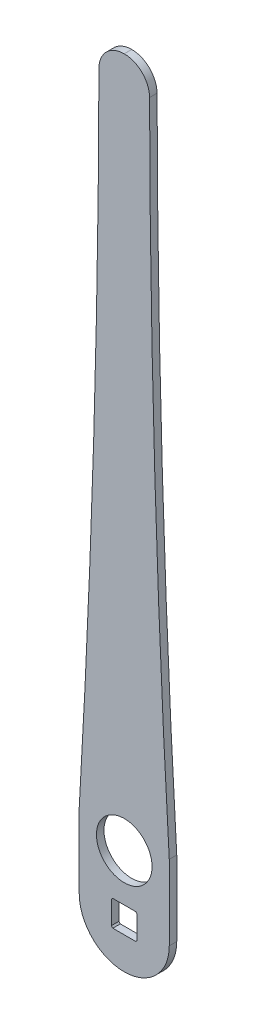
ISO-10303-21;
HEADER;
FILE_DESCRIPTION(('STEP AP214'),'2;1');
FILE_NAME('part.step','',(''),(''),'','','');
FILE_SCHEMA(('AUTOMOTIVE_DESIGN { 1 0 10303 214 1 1 1 1 }'));
ENDSEC;
DATA;
#1=APPLICATION_CONTEXT('core data for automotive mechanical design processes');
#2=APPLICATION_PROTOCOL_DEFINITION('international standard','automotive_design',2000,#1);
#3=PRODUCT_CONTEXT('',#1,'mechanical');
#4=PRODUCT('Part','Part','',(#3));
#5=PRODUCT_RELATED_PRODUCT_CATEGORY('part','',(#4));
#6=PRODUCT_DEFINITION_FORMATION('','',#4);
#7=PRODUCT_DEFINITION_CONTEXT('part definition',#1,'design');
#8=PRODUCT_DEFINITION('design','',#6,#7);
#9=PRODUCT_DEFINITION_SHAPE('','',#8);
#10=(LENGTH_UNIT() NAMED_UNIT(*) SI_UNIT(.MILLI.,.METRE.));
#11=(NAMED_UNIT(*) PLANE_ANGLE_UNIT() SI_UNIT($,.RADIAN.));
#12=(NAMED_UNIT(*) SI_UNIT($,.STERADIAN.) SOLID_ANGLE_UNIT());
#13=UNCERTAINTY_MEASURE_WITH_UNIT(LENGTH_MEASURE(1.E-05),#10,'distance_accuracy_value','');
#14=(GEOMETRIC_REPRESENTATION_CONTEXT(3) GLOBAL_UNCERTAINTY_ASSIGNED_CONTEXT((#13)) GLOBAL_UNIT_ASSIGNED_CONTEXT((#10,
#11,#12)) REPRESENTATION_CONTEXT('',''));
#15=CARTESIAN_POINT('',(0.,0.,0.));
#16=DIRECTION('',(0.,0.,1.));
#17=DIRECTION('',(1.,0.,0.));
#18=AXIS2_PLACEMENT_3D('',#15,#16,#17);
#19=CARTESIAN_POINT('',(-8.6,8.6,-5.));
#20=DIRECTION('',(-1.,0.,0.));
#21=DIRECTION('',(0.,-1.,0.));
#22=AXIS2_PLACEMENT_3D('',#19,#20,#21);
#23=PLANE('',#22);
#24=DIRECTION('',(0.,0.,1.));
#25=VECTOR('',#24,1.);
#26=CARTESIAN_POINT('',(-8.6,-7.63478879865055,-49.424357741048));
#27=LINE('',#26,#25);
#28=CARTESIAN_POINT('',(-8.6,-7.63478879865055,0.));
#29=VERTEX_POINT('',#28);
#30=CARTESIAN_POINT('',(-8.6,-7.63478879865055,5.));
#31=VERTEX_POINT('',#30);
#32=EDGE_CURVE('E281',#29,#31,#27,.T.);
#33=ORIENTED_EDGE('',*,*,#32,.F.);
#34=DIRECTION('',(0.,-1.,0.));
#35=VECTOR('',#34,1.);
#36=CARTESIAN_POINT('',(-8.6,0.,0.));
#37=LINE('',#36,#35);
#38=CARTESIAN_POINT('',(-8.6,7.63478879865055,0.));
#39=VERTEX_POINT('',#38);
#40=EDGE_CURVE('E184',#39,#29,#37,.T.);
#41=ORIENTED_EDGE('',*,*,#40,.F.);
#42=DIRECTION('',(0.,0.,1.));
#43=VECTOR('',#42,1.);
#44=CARTESIAN_POINT('',(-8.6,7.63478879865055,-49.424357741048));
#45=LINE('',#44,#43);
#46=CARTESIAN_POINT('',(-8.6,7.63478879865055,5.));
#47=VERTEX_POINT('',#46);
#48=EDGE_CURVE('E283',#47,#39,#45,.F.);
#49=ORIENTED_EDGE('',*,*,#48,.F.);
#50=DIRECTION('',(0.,-1.,0.));
#51=VECTOR('',#50,1.);
#52=CARTESIAN_POINT('',(-8.6,8.6,5.));
#53=LINE('',#52,#51);
#54=EDGE_CURVE('E278',#47,#31,#53,.T.);
#55=ORIENTED_EDGE('',*,*,#54,.T.);
#56=EDGE_LOOP('',(#33,#41,#49,#55));
#57=FACE_BOUND('',#56,.T.);
#58=ADVANCED_FACE('F39',(#57),#23,.F.);
#59=CARTESIAN_POINT('',(8.6,8.6,-5.));
#60=DIRECTION('',(0.,1.,0.));
#61=DIRECTION('',(-1.,0.,0.));
#62=AXIS2_PLACEMENT_3D('',#59,#60,#61);
#63=PLANE('',#62);
#64=DIRECTION('',(0.,0.,1.));
#65=VECTOR('',#64,1.);
#66=CARTESIAN_POINT('',(-7.63478879865056,8.6,-49.424357741048));
#67=LINE('',#66,#65);
#68=CARTESIAN_POINT('',(-7.63478879865056,8.6,0.));
#69=VERTEX_POINT('',#68);
#70=CARTESIAN_POINT('',(-7.63478879865056,8.6,5.));
#71=VERTEX_POINT('',#70);
#72=EDGE_CURVE('E285',#69,#71,#67,.T.);
#73=ORIENTED_EDGE('',*,*,#72,.F.);
#74=DIRECTION('',(-1.,0.,0.));
#75=VECTOR('',#74,1.);
#76=CARTESIAN_POINT('',(0.,8.6,0.));
#77=LINE('',#76,#75);
#78=CARTESIAN_POINT('',(7.63478879865055,8.6,0.));
#79=VERTEX_POINT('',#78);
#80=EDGE_CURVE('E181',#79,#69,#77,.T.);
#81=ORIENTED_EDGE('',*,*,#80,.F.);
#82=DIRECTION('',(0.,0.,1.));
#83=VECTOR('',#82,1.);
#84=CARTESIAN_POINT('',(7.63478879865055,8.6,-49.424357741048));
#85=LINE('',#84,#83);
#86=CARTESIAN_POINT('',(7.63478879865055,8.6,5.));
#87=VERTEX_POINT('',#86);
#88=EDGE_CURVE('E287',#87,#79,#85,.F.);
#89=ORIENTED_EDGE('',*,*,#88,.F.);
#90=DIRECTION('',(-1.,0.,0.));
#91=VECTOR('',#90,1.);
#92=CARTESIAN_POINT('',(8.6,8.6,5.));
#93=LINE('',#92,#91);
#94=EDGE_CURVE('E264',#87,#71,#93,.T.);
#95=ORIENTED_EDGE('',*,*,#94,.T.);
#96=EDGE_LOOP('',(#73,#81,#89,#95));
#97=FACE_BOUND('',#96,.T.);
#98=ADVANCED_FACE('F326',(#97),#63,.F.);
#99=CARTESIAN_POINT('',(8.6,8.6,-5.));
#100=DIRECTION('',(1.,0.,0.));
#101=DIRECTION('',(0.,1.,0.));
#102=AXIS2_PLACEMENT_3D('',#99,#100,#101);
#103=PLANE('',#102);
#104=DIRECTION('',(0.,0.,1.));
#105=VECTOR('',#104,1.);
#106=CARTESIAN_POINT('',(8.6,7.63478879865056,-49.424357741048));
#107=LINE('',#106,#105);
#108=CARTESIAN_POINT('',(8.6,7.63478879865056,0.));
#109=VERTEX_POINT('',#108);
#110=CARTESIAN_POINT('',(8.6,7.63478879865056,5.));
#111=VERTEX_POINT('',#110);
#112=EDGE_CURVE('E166',#109,#111,#107,.T.);
#113=ORIENTED_EDGE('',*,*,#112,.F.);
#114=DIRECTION('',(0.,1.,0.));
#115=VECTOR('',#114,1.);
#116=CARTESIAN_POINT('',(8.6,0.,0.));
#117=LINE('',#116,#115);
#118=CARTESIAN_POINT('',(8.6,-7.63478879865056,0.));
#119=VERTEX_POINT('',#118);
#120=EDGE_CURVE('E173',#119,#109,#117,.T.);
#121=ORIENTED_EDGE('',*,*,#120,.F.);
#122=DIRECTION('',(0.,0.,1.));
#123=VECTOR('',#122,1.);
#124=CARTESIAN_POINT('',(8.6,-7.63478879865056,-49.424357741048));
#125=LINE('',#124,#123);
#126=CARTESIAN_POINT('',(8.6,-7.63478879865056,5.));
#127=VERTEX_POINT('',#126);
#128=EDGE_CURVE('E155',#127,#119,#125,.F.);
#129=ORIENTED_EDGE('',*,*,#128,.F.);
#130=DIRECTION('',(0.,1.,0.));
#131=VECTOR('',#130,1.);
#132=CARTESIAN_POINT('',(8.6,8.6,5.));
#133=LINE('',#132,#131);
#134=EDGE_CURVE('E266',#127,#111,#133,.T.);
#135=ORIENTED_EDGE('',*,*,#134,.T.);
#136=EDGE_LOOP('',(#113,#121,#129,#135));
#137=FACE_BOUND('',#136,.T.);
#138=ADVANCED_FACE('F180',(#137),#103,.F.);
#139=CARTESIAN_POINT('',(8.6,-8.6,-5.));
#140=DIRECTION('',(0.,-1.,0.));
#141=DIRECTION('',(1.,0.,0.));
#142=AXIS2_PLACEMENT_3D('',#139,#140,#141);
#143=PLANE('',#142);
#144=DIRECTION('',(0.,0.,1.));
#145=VECTOR('',#144,1.);
#146=CARTESIAN_POINT('',(7.63478879865056,-8.6,-49.424357741048));
#147=LINE('',#146,#145);
#148=CARTESIAN_POINT('',(7.63478879865056,-8.6,0.));
#149=VERTEX_POINT('',#148);
#150=CARTESIAN_POINT('',(7.63478879865056,-8.6,5.));
#151=VERTEX_POINT('',#150);
#152=EDGE_CURVE('E195',#149,#151,#147,.T.);
#153=ORIENTED_EDGE('',*,*,#152,.F.);
#154=DIRECTION('',(1.,0.,0.));
#155=VECTOR('',#154,1.);
#156=CARTESIAN_POINT('',(0.,-8.6,0.));
#157=LINE('',#156,#155);
#158=CARTESIAN_POINT('',(-7.63478879865055,-8.6,0.));
#159=VERTEX_POINT('',#158);
#160=EDGE_CURVE('E175',#159,#149,#157,.T.);
#161=ORIENTED_EDGE('',*,*,#160,.F.);
#162=DIRECTION('',(0.,0.,1.));
#163=VECTOR('',#162,1.);
#164=CARTESIAN_POINT('',(-7.63478879865055,-8.6,-49.424357741048));
#165=LINE('',#164,#163);
#166=CARTESIAN_POINT('',(-7.63478879865055,-8.6,5.));
#167=VERTEX_POINT('',#166);
#168=EDGE_CURVE('E192',#167,#159,#165,.F.);
#169=ORIENTED_EDGE('',*,*,#168,.F.);
#170=DIRECTION('',(1.,0.,0.));
#171=VECTOR('',#170,1.);
#172=CARTESIAN_POINT('',(8.6,-8.6,5.));
#173=LINE('',#172,#171);
#174=EDGE_CURVE('E275',#167,#151,#173,.T.);
#175=ORIENTED_EDGE('',*,*,#174,.T.);
#176=EDGE_LOOP('',(#153,#161,#169,#175));
#177=FACE_BOUND('',#176,.T.);
#178=ADVANCED_FACE('F317',(#177),#143,.F.);
#179=CARTESIAN_POINT('',(0.,0.,5.));
#180=DIRECTION('',(0.,0.,-1.));
#181=DIRECTION('',(-1.,0.,0.));
#182=AXIS2_PLACEMENT_3D('',#179,#180,#181);
#183=CYLINDRICAL_SURFACE('',#182,30.);
#184=CARTESIAN_POINT('',(0.,0.,0.));
#185=DIRECTION('',(0.,0.,1.));
#186=DIRECTION('',(1.,0.,0.));
#187=AXIS2_PLACEMENT_3D('',#184,#185,#186);
#188=CIRCLE('',#187,30.);
#189=CARTESIAN_POINT('',(-30.,0.,0.));
#190=VERTEX_POINT('',#189);
#191=CARTESIAN_POINT('',(30.,0.,0.));
#192=VERTEX_POINT('',#191);
#193=EDGE_CURVE('E236',#190,#192,#188,.T.);
#194=ORIENTED_EDGE('',*,*,#193,.T.);
#195=DIRECTION('',(0.,0.,-1.));
#196=VECTOR('',#195,1.);
#197=CARTESIAN_POINT('',(30.,0.,5.));
#198=LINE('',#197,#196);
#199=CARTESIAN_POINT('',(30.,0.,5.));
#200=VERTEX_POINT('',#199);
#201=EDGE_CURVE('E186',#200,#192,#198,.T.);
#202=ORIENTED_EDGE('',*,*,#201,.F.);
#203=CARTESIAN_POINT('',(0.,0.,5.));
#204=DIRECTION('',(0.,0.,1.));
#205=DIRECTION('',(1.,0.,0.));
#206=AXIS2_PLACEMENT_3D('',#203,#204,#205);
#207=CIRCLE('',#206,30.);
#208=CARTESIAN_POINT('',(-30.,0.,5.));
#209=VERTEX_POINT('',#208);
#210=EDGE_CURVE('E243',#209,#200,#207,.T.);
#211=ORIENTED_EDGE('',*,*,#210,.F.);
#212=DIRECTION('',(0.,0.,-1.));
#213=VECTOR('',#212,1.);
#214=CARTESIAN_POINT('',(-30.,0.,5.));
#215=LINE('',#214,#213);
#216=EDGE_CURVE('E244',#209,#190,#215,.T.);
#217=ORIENTED_EDGE('',*,*,#216,.T.);
#218=EDGE_LOOP('',(#194,#202,#211,#217));
#219=FACE_BOUND('',#218,.T.);
#220=ADVANCED_FACE('F261',(#219),#183,.T.);
#221=CARTESIAN_POINT('',(30.,0.,5.));
#222=DIRECTION('',(-1.,0.,0.));
#223=DIRECTION('',(0.,0.,1.));
#224=AXIS2_PLACEMENT_3D('',#221,#222,#223);
#225=PLANE('',#224);
#226=DIRECTION('',(0.,1.,0.));
#227=VECTOR('',#226,1.);
#228=CARTESIAN_POINT('',(30.,0.,0.));
#229=LINE('',#228,#227);
#230=CARTESIAN_POINT('',(29.9999999999994,50.0000000000009,0.));
#231=VERTEX_POINT('',#230);
#232=EDGE_CURVE('E232',#192,#231,#229,.T.);
#233=ORIENTED_EDGE('',*,*,#232,.T.);
#234=DIRECTION('',(0.,0.,-1.));
#235=VECTOR('',#234,1.);
#236=CARTESIAN_POINT('',(29.9999999999994,50.0000000000009,5.));
#237=LINE('',#236,#235);
#238=CARTESIAN_POINT('',(29.9999999999994,50.0000000000009,5.));
#239=VERTEX_POINT('',#238);
#240=EDGE_CURVE('E231',#239,#231,#237,.T.);
#241=ORIENTED_EDGE('',*,*,#240,.F.);
#242=DIRECTION('',(0.,1.,0.));
#243=VECTOR('',#242,1.);
#244=CARTESIAN_POINT('',(30.,0.,5.));
#245=LINE('',#244,#243);
#246=EDGE_CURVE('E256',#200,#239,#245,.T.);
#247=ORIENTED_EDGE('',*,*,#246,.F.);
#248=ORIENTED_EDGE('',*,*,#201,.T.);
#249=EDGE_LOOP('',(#233,#241,#247,#248));
#250=FACE_BOUND('',#249,.T.);
#251=ADVANCED_FACE('F255',(#250),#225,.F.);
#252=CARTESIAN_POINT('',(7723.04477186312,500.,5.));
#253=DIRECTION('',(0.,0.,-1.));
#254=DIRECTION('',(-1.,0.,0.));
#255=AXIS2_PLACEMENT_3D('',#252,#253,#254);
#256=CYLINDRICAL_SURFACE('',#255,7706.19477186312);
#257=CARTESIAN_POINT('',(7723.04477186312,500.,0.));
#258=DIRECTION('',(0.,0.,-1.));
#259=DIRECTION('',(-1.,0.,0.));
#260=AXIS2_PLACEMENT_3D('',#257,#258,#259);
#261=CIRCLE('',#260,7706.19477186312);
#262=CARTESIAN_POINT('',(16.8683414306479,483.186763026551,0.));
#263=VERTEX_POINT('',#262);
#264=EDGE_CURVE('E226',#231,#263,#261,.T.);
#265=ORIENTED_EDGE('',*,*,#264,.T.);
#266=DIRECTION('',(0.,0.,-1.));
#267=VECTOR('',#266,1.);
#268=CARTESIAN_POINT('',(16.8683414306461,483.186763026551,5.));
#269=LINE('',#268,#267);
#270=CARTESIAN_POINT('',(16.8683414306479,483.186763026551,5.));
#271=VERTEX_POINT('',#270);
#272=EDGE_CURVE('E63',#263,#271,#269,.F.);
#273=ORIENTED_EDGE('',*,*,#272,.T.);
#274=CARTESIAN_POINT('',(7723.04477186312,500.,5.));
#275=DIRECTION('',(0.,0.,-1.));
#276=DIRECTION('',(-1.,0.,0.));
#277=AXIS2_PLACEMENT_3D('',#274,#275,#276);
#278=CIRCLE('',#277,7706.19477186312);
#279=EDGE_CURVE('E213',#239,#271,#278,.T.);
#280=ORIENTED_EDGE('',*,*,#279,.F.);
#281=ORIENTED_EDGE('',*,*,#240,.T.);
#282=EDGE_LOOP('',(#265,#273,#280,#281));
#283=FACE_BOUND('',#282,.T.);
#284=ADVANCED_FACE('F229',(#283),#256,.F.);
#285=CARTESIAN_POINT('',(-16.8499999999998,500.,5.));
#286=DIRECTION('',(0.,-1.,0.));
#287=DIRECTION('',(0.,0.,-1.));
#288=AXIS2_PLACEMENT_3D('',#285,#286,#287);
#289=PLANE('',#288);
#290=DIRECTION('',(-1.,0.,0.));
#291=VECTOR('',#290,1.);
#292=CARTESIAN_POINT('',(-16.8499999999998,500.,5.));
#293=LINE('',#292,#291);
#294=CARTESIAN_POINT('',(0.0183815351508798,500.,5.));
#295=VERTEX_POINT('',#294);
#296=CARTESIAN_POINT('',(-0.0183815351508798,500.,5.));
#297=VERTEX_POINT('',#296);
#298=EDGE_CURVE('E212',#295,#297,#293,.T.);
#299=ORIENTED_EDGE('',*,*,#298,.F.);
#300=DIRECTION('',(0.,0.,-1.));
#301=VECTOR('',#300,1.);
#302=CARTESIAN_POINT('',(0.0183815351508798,500.,5.));
#303=LINE('',#302,#301);
#304=CARTESIAN_POINT('',(0.0183815351508798,500.,0.));
#305=VERTEX_POINT('',#304);
#306=EDGE_CURVE('E199',#295,#305,#303,.T.);
#307=ORIENTED_EDGE('',*,*,#306,.T.);
#308=DIRECTION('',(-1.,0.,0.));
#309=VECTOR('',#308,1.);
#310=CARTESIAN_POINT('',(-16.8499999999998,500.,0.));
#311=LINE('',#310,#309);
#312=CARTESIAN_POINT('',(-0.0183815351508798,500.,0.));
#313=VERTEX_POINT('',#312);
#314=EDGE_CURVE('E227',#305,#313,#311,.T.);
#315=ORIENTED_EDGE('',*,*,#314,.T.);
#316=DIRECTION('',(0.,0.,-1.));
#317=VECTOR('',#316,1.);
#318=CARTESIAN_POINT('',(-0.0183815351508798,500.,5.));
#319=LINE('',#318,#317);
#320=EDGE_CURVE('E197',#313,#297,#319,.F.);
#321=ORIENTED_EDGE('',*,*,#320,.T.);
#322=EDGE_LOOP('',(#299,#307,#315,#321));
#323=FACE_BOUND('',#322,.T.);
#324=ADVANCED_FACE('F217',(#323),#289,.F.);
#325=CARTESIAN_POINT('',(-7723.04477186312,500.,5.));
#326=DIRECTION('',(0.,0.,-1.));
#327=DIRECTION('',(-1.,0.,0.));
#328=AXIS2_PLACEMENT_3D('',#325,#326,#327);
#329=CYLINDRICAL_SURFACE('',#328,7706.19477186312);
#330=CARTESIAN_POINT('',(-7723.04477186312,500.,5.));
#331=DIRECTION('',(0.,0.,-1.));
#332=DIRECTION('',(1.,0.,0.));
#333=AXIS2_PLACEMENT_3D('',#330,#331,#332);
#334=CIRCLE('',#333,7706.19477186312);
#335=CARTESIAN_POINT('',(-16.8683414306479,483.186763026551,5.));
#336=VERTEX_POINT('',#335);
#337=CARTESIAN_POINT('',(-30.,50.,5.));
#338=VERTEX_POINT('',#337);
#339=EDGE_CURVE('E221',#336,#338,#334,.T.);
#340=ORIENTED_EDGE('',*,*,#339,.F.);
#341=DIRECTION('',(0.,0.,-1.));
#342=VECTOR('',#341,1.);
#343=CARTESIAN_POINT('',(-16.8683414306461,483.186763026551,5.));
#344=LINE('',#343,#342);
#345=CARTESIAN_POINT('',(-16.8683414306479,483.186763026551,0.));
#346=VERTEX_POINT('',#345);
#347=EDGE_CURVE('E11',#336,#346,#344,.T.);
#348=ORIENTED_EDGE('',*,*,#347,.T.);
#349=CARTESIAN_POINT('',(-7723.04477186312,500.,0.));
#350=DIRECTION('',(0.,0.,-1.));
#351=DIRECTION('',(1.,0.,0.));
#352=AXIS2_PLACEMENT_3D('',#349,#350,#351);
#353=CIRCLE('',#352,7706.19477186312);
#354=CARTESIAN_POINT('',(-30.,50.,0.));
#355=VERTEX_POINT('',#354);
#356=EDGE_CURVE('E234',#346,#355,#353,.T.);
#357=ORIENTED_EDGE('',*,*,#356,.T.);
#358=DIRECTION('',(0.,0.,-1.));
#359=VECTOR('',#358,1.);
#360=CARTESIAN_POINT('',(-30.,50.,5.));
#361=LINE('',#360,#359);
#362=EDGE_CURVE('E247',#338,#355,#361,.T.);
#363=ORIENTED_EDGE('',*,*,#362,.F.);
#364=EDGE_LOOP('',(#340,#348,#357,#363));
#365=FACE_BOUND('',#364,.T.);
#366=ADVANCED_FACE('F348',(#365),#329,.F.);
#367=CARTESIAN_POINT('',(-30.,0.,5.));
#368=DIRECTION('',(1.,0.,0.));
#369=DIRECTION('',(0.,0.,-1.));
#370=AXIS2_PLACEMENT_3D('',#367,#368,#369);
#371=PLANE('',#370);
#372=DIRECTION('',(0.,-1.,0.));
#373=VECTOR('',#372,1.);
#374=CARTESIAN_POINT('',(-30.,0.,0.));
#375=LINE('',#374,#373);
#376=EDGE_CURVE('E241',#355,#190,#375,.T.);
#377=ORIENTED_EDGE('',*,*,#376,.T.);
#378=ORIENTED_EDGE('',*,*,#216,.F.);
#379=DIRECTION('',(0.,-1.,0.));
#380=VECTOR('',#379,1.);
#381=CARTESIAN_POINT('',(-30.,0.,5.));
#382=LINE('',#381,#380);
#383=EDGE_CURVE('E248',#338,#209,#382,.T.);
#384=ORIENTED_EDGE('',*,*,#383,.F.);
#385=ORIENTED_EDGE('',*,*,#362,.T.);
#386=EDGE_LOOP('',(#377,#378,#384,#385));
#387=FACE_BOUND('',#386,.T.);
#388=ADVANCED_FACE('F342',(#387),#371,.F.);
#389=CARTESIAN_POINT('',(0.,0.,5.));
#390=DIRECTION('',(0.,0.,1.));
#391=DIRECTION('',(1.,0.,0.));
#392=AXIS2_PLACEMENT_3D('',#389,#390,#391);
#393=PLANE('',#392);
#394=CARTESIAN_POINT('',(0.,40.,5.));
#395=DIRECTION('',(0.,0.,1.));
#396=DIRECTION('',(1.,0.,0.));
#397=AXIS2_PLACEMENT_3D('',#394,#395,#396);
#398=CIRCLE('',#397,18.5371317381859);
#399=CARTESIAN_POINT('',(18.5371317381859,40.,5.));
#400=VERTEX_POINT('',#399);
#401=EDGE_CURVE('E293',#400,#400,#398,.T.);
#402=ORIENTED_EDGE('',*,*,#401,.F.);
#403=EDGE_LOOP('',(#402));
#404=FACE_BOUND('',#403,.T.);
#405=ORIENTED_EDGE('',*,*,#279,.T.);
#406=CARTESIAN_POINT('',(0.0183815351508798,483.15,5.));
#407=DIRECTION('',(0.,0.,1.));
#408=DIRECTION('',(1.,0.,0.));
#409=AXIS2_PLACEMENT_3D('',#406,#407,#408);
#410=CIRCLE('',#409,16.85);
#411=EDGE_CURVE('E48',#271,#295,#410,.T.);
#412=ORIENTED_EDGE('',*,*,#411,.T.);
#413=ORIENTED_EDGE('',*,*,#298,.T.);
#414=CARTESIAN_POINT('',(-0.0183815351508798,483.15,5.));
#415=DIRECTION('',(0.,0.,1.));
#416=DIRECTION('',(1.,0.,0.));
#417=AXIS2_PLACEMENT_3D('',#414,#415,#416);
#418=CIRCLE('',#417,16.85);
#419=EDGE_CURVE('E55',#297,#336,#418,.T.);
#420=ORIENTED_EDGE('',*,*,#419,.T.);
#421=ORIENTED_EDGE('',*,*,#339,.T.);
#422=ORIENTED_EDGE('',*,*,#383,.T.);
#423=ORIENTED_EDGE('',*,*,#210,.T.);
#424=ORIENTED_EDGE('',*,*,#246,.T.);
#425=EDGE_LOOP('',(#405,#412,#413,#420,#421,#422,#423,#424));
#426=FACE_BOUND('',#425,.T.);
#427=ORIENTED_EDGE('',*,*,#134,.F.);
#428=CARTESIAN_POINT('',(0.,0.,5.));
#429=DIRECTION('',(0.,0.,1.));
#430=DIRECTION('',(1.,0.,0.));
#431=AXIS2_PLACEMENT_3D('',#428,#429,#430);
#432=CIRCLE('',#431,11.5);
#433=EDGE_CURVE('E161',#151,#127,#432,.T.);
#434=ORIENTED_EDGE('',*,*,#433,.F.);
#435=ORIENTED_EDGE('',*,*,#174,.F.);
#436=EDGE_CURVE('E300',#31,#167,#432,.T.);
#437=ORIENTED_EDGE('',*,*,#436,.F.);
#438=ORIENTED_EDGE('',*,*,#54,.F.);
#439=EDGE_CURVE('E292',#71,#47,#432,.T.);
#440=ORIENTED_EDGE('',*,*,#439,.F.);
#441=ORIENTED_EDGE('',*,*,#94,.F.);
#442=EDGE_CURVE('E290',#111,#87,#432,.T.);
#443=ORIENTED_EDGE('',*,*,#442,.F.);
#444=EDGE_LOOP('',(#427,#434,#435,#437,#438,#440,#441,#443));
#445=FACE_BOUND('',#444,.T.);
#446=ADVANCED_FACE('F210',(#404,#426,#445),#393,.T.);
#447=CARTESIAN_POINT('',(0.,0.,0.));
#448=DIRECTION('',(0.,0.,1.));
#449=DIRECTION('',(1.,0.,0.));
#450=AXIS2_PLACEMENT_3D('',#447,#448,#449);
#451=PLANE('',#450);
#452=CARTESIAN_POINT('',(0.,40.,0.));
#453=DIRECTION('',(0.,0.,1.));
#454=DIRECTION('',(1.,0.,0.));
#455=AXIS2_PLACEMENT_3D('',#452,#453,#454);
#456=CIRCLE('',#455,18.5371317381859);
#457=CARTESIAN_POINT('',(18.5371317381859,40.,0.));
#458=VERTEX_POINT('',#457);
#459=EDGE_CURVE('E43',#458,#458,#456,.T.);
#460=ORIENTED_EDGE('',*,*,#459,.T.);
#461=EDGE_LOOP('',(#460));
#462=FACE_BOUND('',#461,.T.);
#463=ORIENTED_EDGE('',*,*,#314,.F.);
#464=CARTESIAN_POINT('',(0.0183815351508798,483.15,0.));
#465=DIRECTION('',(0.,0.,1.));
#466=DIRECTION('',(1.,0.,0.));
#467=AXIS2_PLACEMENT_3D('',#464,#465,#466);
#468=CIRCLE('',#467,16.85);
#469=EDGE_CURVE('E204',#305,#263,#468,.F.);
#470=ORIENTED_EDGE('',*,*,#469,.T.);
#471=ORIENTED_EDGE('',*,*,#264,.F.);
#472=ORIENTED_EDGE('',*,*,#232,.F.);
#473=ORIENTED_EDGE('',*,*,#193,.F.);
#474=ORIENTED_EDGE('',*,*,#376,.F.);
#475=ORIENTED_EDGE('',*,*,#356,.F.);
#476=CARTESIAN_POINT('',(-0.0183815351508798,483.15,0.));
#477=DIRECTION('',(0.,0.,1.));
#478=DIRECTION('',(1.,0.,0.));
#479=AXIS2_PLACEMENT_3D('',#476,#477,#478);
#480=CIRCLE('',#479,16.85);
#481=EDGE_CURVE('E202',#346,#313,#480,.F.);
#482=ORIENTED_EDGE('',*,*,#481,.T.);
#483=EDGE_LOOP('',(#463,#470,#471,#472,#473,#474,#475,#482));
#484=FACE_BOUND('',#483,.T.);
#485=ORIENTED_EDGE('',*,*,#120,.T.);
#486=CARTESIAN_POINT('',(0.,0.,0.));
#487=DIRECTION('',(0.,0.,1.));
#488=DIRECTION('',(1.,0.,0.));
#489=AXIS2_PLACEMENT_3D('',#486,#487,#488);
#490=CIRCLE('',#489,11.5);
#491=EDGE_CURVE('E178',#79,#109,#490,.F.);
#492=ORIENTED_EDGE('',*,*,#491,.F.);
#493=ORIENTED_EDGE('',*,*,#80,.T.);
#494=EDGE_CURVE('E319',#39,#69,#490,.F.);
#495=ORIENTED_EDGE('',*,*,#494,.F.);
#496=ORIENTED_EDGE('',*,*,#40,.T.);
#497=EDGE_CURVE('E176',#159,#29,#490,.F.);
#498=ORIENTED_EDGE('',*,*,#497,.F.);
#499=ORIENTED_EDGE('',*,*,#160,.T.);
#500=EDGE_CURVE('E158',#119,#149,#490,.F.);
#501=ORIENTED_EDGE('',*,*,#500,.F.);
#502=EDGE_LOOP('',(#485,#492,#493,#495,#496,#498,#499,#501));
#503=FACE_BOUND('',#502,.T.);
#504=ADVANCED_FACE('F171',(#462,#484,#503),#451,.F.);
#505=CARTESIAN_POINT('',(0.,0.,-49.424357741048));
#506=DIRECTION('',(0.,0.,1.));
#507=DIRECTION('',(1.,0.,0.));
#508=AXIS2_PLACEMENT_3D('',#505,#506,#507);
#509=CYLINDRICAL_SURFACE('',#508,11.5);
#510=ORIENTED_EDGE('',*,*,#497,.T.);
#511=ORIENTED_EDGE('',*,*,#32,.T.);
#512=ORIENTED_EDGE('',*,*,#436,.T.);
#513=ORIENTED_EDGE('',*,*,#168,.T.);
#514=EDGE_LOOP('',(#510,#511,#512,#513));
#515=FACE_BOUND('',#514,.T.);
#516=ADVANCED_FACE('F318',(#515),#509,.F.);
#517=ORIENTED_EDGE('',*,*,#433,.T.);
#518=ORIENTED_EDGE('',*,*,#128,.T.);
#519=ORIENTED_EDGE('',*,*,#500,.T.);
#520=ORIENTED_EDGE('',*,*,#152,.T.);
#521=EDGE_LOOP('',(#517,#518,#519,#520));
#522=FACE_BOUND('',#521,.T.);
#523=ADVANCED_FACE('F157',(#522),#509,.F.);
#524=ORIENTED_EDGE('',*,*,#442,.T.);
#525=ORIENTED_EDGE('',*,*,#88,.T.);
#526=ORIENTED_EDGE('',*,*,#491,.T.);
#527=ORIENTED_EDGE('',*,*,#112,.T.);
#528=EDGE_LOOP('',(#524,#525,#526,#527));
#529=FACE_BOUND('',#528,.T.);
#530=ADVANCED_FACE('F322',(#529),#509,.F.);
#531=ORIENTED_EDGE('',*,*,#439,.T.);
#532=ORIENTED_EDGE('',*,*,#48,.T.);
#533=ORIENTED_EDGE('',*,*,#494,.T.);
#534=ORIENTED_EDGE('',*,*,#72,.T.);
#535=EDGE_LOOP('',(#531,#532,#533,#534));
#536=FACE_BOUND('',#535,.T.);
#537=ADVANCED_FACE('F307',(#536),#509,.F.);
#538=CARTESIAN_POINT('',(0.0183815351508798,483.15,5.));
#539=DIRECTION('',(0.,0.,-1.));
#540=DIRECTION('',(-1.,0.,0.));
#541=AXIS2_PLACEMENT_3D('',#538,#539,#540);
#542=CYLINDRICAL_SURFACE('',#541,16.85);
#543=ORIENTED_EDGE('',*,*,#411,.F.);
#544=ORIENTED_EDGE('',*,*,#272,.F.);
#545=ORIENTED_EDGE('',*,*,#469,.F.);
#546=ORIENTED_EDGE('',*,*,#306,.F.);
#547=EDGE_LOOP('',(#543,#544,#545,#546));
#548=FACE_BOUND('',#547,.T.);
#549=ADVANCED_FACE('F223',(#548),#542,.T.);
#550=CARTESIAN_POINT('',(-0.0183815351508798,483.15,5.));
#551=DIRECTION('',(0.,0.,-1.));
#552=DIRECTION('',(-1.,0.,0.));
#553=AXIS2_PLACEMENT_3D('',#550,#551,#552);
#554=CYLINDRICAL_SURFACE('',#553,16.85);
#555=ORIENTED_EDGE('',*,*,#419,.F.);
#556=ORIENTED_EDGE('',*,*,#320,.F.);
#557=ORIENTED_EDGE('',*,*,#481,.F.);
#558=ORIENTED_EDGE('',*,*,#347,.F.);
#559=EDGE_LOOP('',(#555,#556,#557,#558));
#560=FACE_BOUND('',#559,.T.);
#561=ADVANCED_FACE('F41',(#560),#554,.T.);
#562=CARTESIAN_POINT('',(0.,40.,-5.));
#563=DIRECTION('',(0.,0.,1.));
#564=DIRECTION('',(1.,0.,0.));
#565=AXIS2_PLACEMENT_3D('',#562,#563,#564);
#566=CYLINDRICAL_SURFACE('',#565,18.5371317381859);
#567=ORIENTED_EDGE('',*,*,#401,.T.);
#568=EDGE_LOOP('',(#567));
#569=FACE_BOUND('',#568,.T.);
#570=ORIENTED_EDGE('',*,*,#459,.F.);
#571=EDGE_LOOP('',(#570));
#572=FACE_BOUND('',#571,.T.);
#573=ADVANCED_FACE('F365',(#569,#572),#566,.F.);
#574=CLOSED_SHELL('',(#58,#98,#138,#178,#220,#251,#284,#324,#366,#388,#446,#504,#516,#523,#530,
#537,#549,#561,#573));
#575=MANIFOLD_SOLID_BREP('B2',#574);
#576=ADVANCED_BREP_SHAPE_REPRESENTATION('',(#18,#575),#14);
#577=SHAPE_DEFINITION_REPRESENTATION(#9,#576);
ENDSEC;
END-ISO-10303-21;
